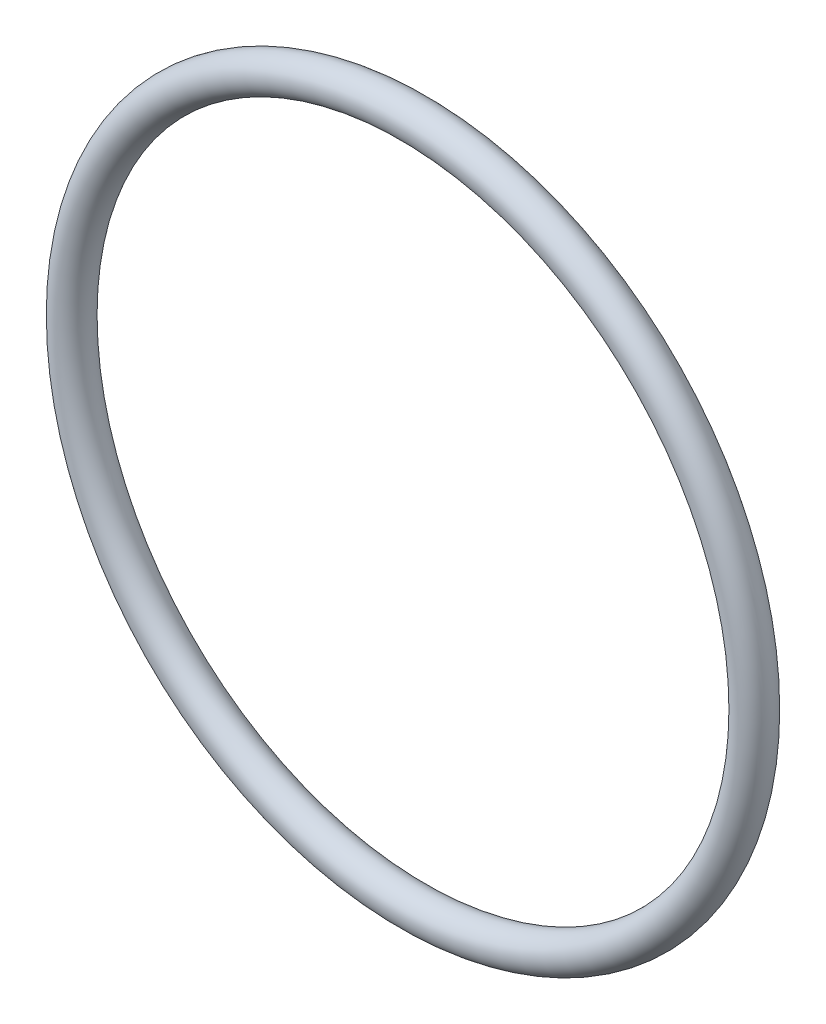
ISO-10303-21;
HEADER;
FILE_DESCRIPTION(('STEP AP214'),'2;1');
FILE_NAME('part.step','',(''),(''),'','','');
FILE_SCHEMA(('AUTOMOTIVE_DESIGN { 1 0 10303 214 1 1 1 1 }'));
ENDSEC;
DATA;
#1=APPLICATION_CONTEXT('core data for automotive mechanical design processes');
#2=APPLICATION_PROTOCOL_DEFINITION('international standard','automotive_design',2000,#1);
#3=PRODUCT_CONTEXT('',#1,'mechanical');
#4=PRODUCT('Part','Part','',(#3));
#5=PRODUCT_RELATED_PRODUCT_CATEGORY('part','',(#4));
#6=PRODUCT_DEFINITION_FORMATION('','',#4);
#7=PRODUCT_DEFINITION_CONTEXT('part definition',#1,'design');
#8=PRODUCT_DEFINITION('design','',#6,#7);
#9=PRODUCT_DEFINITION_SHAPE('','',#8);
#10=(LENGTH_UNIT() NAMED_UNIT(*) SI_UNIT(.MILLI.,.METRE.));
#11=(NAMED_UNIT(*) PLANE_ANGLE_UNIT() SI_UNIT($,.RADIAN.));
#12=(NAMED_UNIT(*) SI_UNIT($,.STERADIAN.) SOLID_ANGLE_UNIT());
#13=UNCERTAINTY_MEASURE_WITH_UNIT(LENGTH_MEASURE(1.E-05),#10,'distance_accuracy_value','');
#14=(GEOMETRIC_REPRESENTATION_CONTEXT(3) GLOBAL_UNCERTAINTY_ASSIGNED_CONTEXT((#13)) GLOBAL_UNIT_ASSIGNED_CONTEXT((#10,
#11,#12)) REPRESENTATION_CONTEXT('',''));
#15=CARTESIAN_POINT('',(0.,0.,0.));
#16=DIRECTION('',(0.,0.,1.));
#17=DIRECTION('',(1.,0.,0.));
#18=AXIS2_PLACEMENT_3D('',#15,#16,#17);
#19=CARTESIAN_POINT('',(0.,0.,0.));
#20=DIRECTION('',(0.,0.,1.));
#21=DIRECTION('',(1.,0.,0.));
#22=AXIS2_PLACEMENT_3D('',#19,#20,#21);
#23=TOROIDAL_SURFACE('',#22,14.25,0.750000000000001);
#24=CARTESIAN_POINT('',(15.,0.,0.));
#25=VERTEX_POINT('',#24);
#26=VERTEX_LOOP('',#25);
#27=FACE_BOUND('',#26,.T.);
#28=ADVANCED_FACE('F29',(#27),#23,.T.);
#29=CLOSED_SHELL('',(#28));
#30=MANIFOLD_SOLID_BREP('B2',#29);
#31=ADVANCED_BREP_SHAPE_REPRESENTATION('',(#18,#30),#14);
#32=SHAPE_DEFINITION_REPRESENTATION(#9,#31);
ENDSEC;
END-ISO-10303-21;
